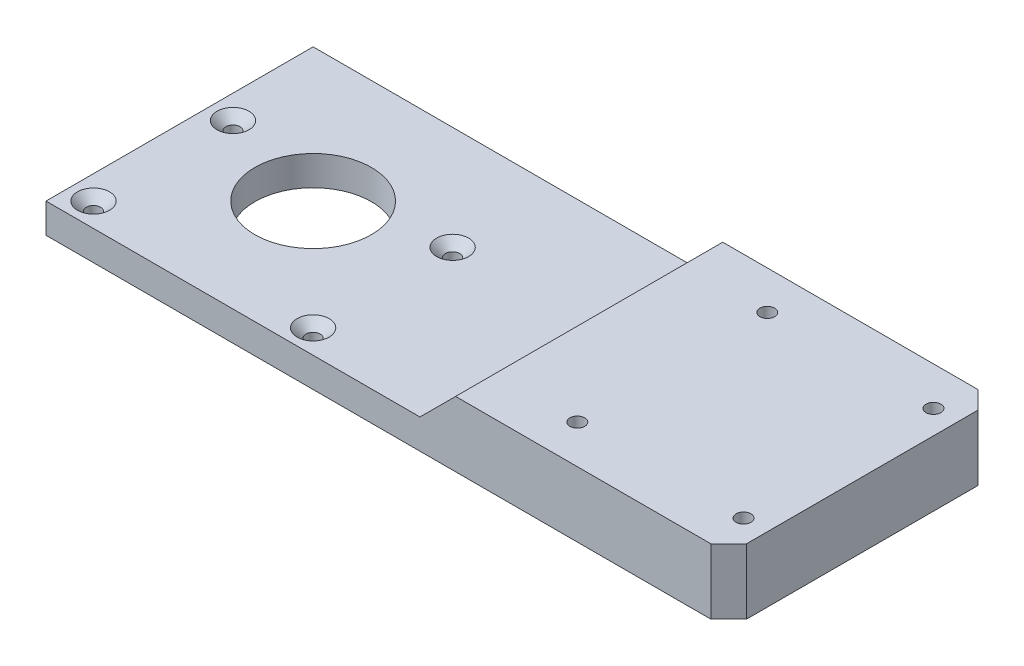
ISO-10303-21;
HEADER;
FILE_DESCRIPTION(('STEP AP214'),'2;1');
FILE_NAME('part.step','',(''),(''),'','','');
FILE_SCHEMA(('AUTOMOTIVE_DESIGN { 1 0 10303 214 1 1 1 1 }'));
ENDSEC;
DATA;
#1=APPLICATION_CONTEXT('core data for automotive mechanical design processes');
#2=APPLICATION_PROTOCOL_DEFINITION('international standard','automotive_design',2000,#1);
#3=PRODUCT_CONTEXT('',#1,'mechanical');
#4=PRODUCT('Part','Part','',(#3));
#5=PRODUCT_RELATED_PRODUCT_CATEGORY('part','',(#4));
#6=PRODUCT_DEFINITION_FORMATION('','',#4);
#7=PRODUCT_DEFINITION_CONTEXT('part definition',#1,'design');
#8=PRODUCT_DEFINITION('design','',#6,#7);
#9=PRODUCT_DEFINITION_SHAPE('','',#8);
#10=(LENGTH_UNIT() NAMED_UNIT(*) SI_UNIT(.MILLI.,.METRE.));
#11=(NAMED_UNIT(*) PLANE_ANGLE_UNIT() SI_UNIT($,.RADIAN.));
#12=(NAMED_UNIT(*) SI_UNIT($,.STERADIAN.) SOLID_ANGLE_UNIT());
#13=UNCERTAINTY_MEASURE_WITH_UNIT(LENGTH_MEASURE(1.E-05),#10,'distance_accuracy_value','');
#14=(GEOMETRIC_REPRESENTATION_CONTEXT(3) GLOBAL_UNCERTAINTY_ASSIGNED_CONTEXT((#13)) GLOBAL_UNIT_ASSIGNED_CONTEXT((#10,
#11,#12)) REPRESENTATION_CONTEXT('',''));
#15=CARTESIAN_POINT('',(0.,0.,0.));
#16=DIRECTION('',(0.,0.,1.));
#17=DIRECTION('',(1.,0.,0.));
#18=AXIS2_PLACEMENT_3D('',#15,#16,#17);
#19=CARTESIAN_POINT('',(0.,11.,0.));
#20=DIRECTION('',(0.,-1.,0.));
#21=DIRECTION('',(0.,0.,-1.));
#22=AXIS2_PLACEMENT_3D('',#19,#20,#21);
#23=PLANE('',#22);
#24=CARTESIAN_POINT('',(83.,11.,-16.));
#25=DIRECTION('',(0.,1.,0.));
#26=DIRECTION('',(0.,0.,1.));
#27=AXIS2_PLACEMENT_3D('',#24,#25,#26);
#28=CIRCLE('',#27,1.24999999999999);
#29=CARTESIAN_POINT('',(83.,11.,-14.75));
#30=VERTEX_POINT('',#29);
#31=EDGE_CURVE('E357',#30,#30,#28,.T.);
#32=ORIENTED_EDGE('',*,*,#31,.F.);
#33=EDGE_LOOP('',(#32));
#34=FACE_BOUND('',#33,.T.);
#35=CARTESIAN_POINT('',(111.,11.,-16.));
#36=DIRECTION('',(0.,1.,0.));
#37=DIRECTION('',(0.,0.,1.));
#38=AXIS2_PLACEMENT_3D('',#35,#36,#37);
#39=CIRCLE('',#38,1.24999999999999);
#40=CARTESIAN_POINT('',(111.,11.,-14.75));
#41=VERTEX_POINT('',#40);
#42=EDGE_CURVE('E353',#41,#41,#39,.T.);
#43=ORIENTED_EDGE('',*,*,#42,.F.);
#44=EDGE_LOOP('',(#43));
#45=FACE_BOUND('',#44,.T.);
#46=CARTESIAN_POINT('',(111.,11.,16.));
#47=DIRECTION('',(0.,1.,0.));
#48=DIRECTION('',(0.,0.,1.));
#49=AXIS2_PLACEMENT_3D('',#46,#47,#48);
#50=CIRCLE('',#49,1.24999999999999);
#51=CARTESIAN_POINT('',(111.,11.,17.25));
#52=VERTEX_POINT('',#51);
#53=EDGE_CURVE('E136',#52,#52,#50,.T.);
#54=ORIENTED_EDGE('',*,*,#53,.F.);
#55=EDGE_LOOP('',(#54));
#56=FACE_BOUND('',#55,.T.);
#57=DIRECTION('',(0.,0.,-1.));
#58=VECTOR('',#57,1.);
#59=CARTESIAN_POINT('',(115.,11.,-22.5));
#60=LINE('',#59,#58);
#61=CARTESIAN_POINT('',(115.,11.,19.5));
#62=VERTEX_POINT('',#61);
#63=CARTESIAN_POINT('',(115.,11.,-19.5));
#64=VERTEX_POINT('',#63);
#65=EDGE_CURVE('E130',#62,#64,#60,.T.);
#66=ORIENTED_EDGE('',*,*,#65,.T.);
#67=DIRECTION('',(-0.707106781186546,0.,-0.707106781186549));
#68=VECTOR('',#67,1.);
#69=CARTESIAN_POINT('',(112.,11.,-22.5));
#70=LINE('',#69,#68);
#71=CARTESIAN_POINT('',(112.,11.,-22.5));
#72=VERTEX_POINT('',#71);
#73=EDGE_CURVE('E46',#64,#72,#70,.T.);
#74=ORIENTED_EDGE('',*,*,#73,.T.);
#75=DIRECTION('',(-1.,0.,0.));
#76=VECTOR('',#75,1.);
#77=CARTESIAN_POINT('',(115.,11.,-22.5));
#78=LINE('',#77,#76);
#79=CARTESIAN_POINT('',(69.,11.,-22.5));
#80=VERTEX_POINT('',#79);
#81=EDGE_CURVE('E133',#72,#80,#78,.T.);
#82=ORIENTED_EDGE('',*,*,#81,.T.);
#83=DIRECTION('',(0.,0.,1.));
#84=VECTOR('',#83,1.);
#85=CARTESIAN_POINT('',(69.,11.,0.));
#86=LINE('',#85,#84);
#87=CARTESIAN_POINT('',(69.,11.,22.5));
#88=VERTEX_POINT('',#87);
#89=EDGE_CURVE('E114',#80,#88,#86,.T.);
#90=ORIENTED_EDGE('',*,*,#89,.T.);
#91=DIRECTION('',(1.,0.,0.));
#92=VECTOR('',#91,1.);
#93=CARTESIAN_POINT('',(115.,11.,22.5));
#94=LINE('',#93,#92);
#95=CARTESIAN_POINT('',(112.,11.,22.5));
#96=VERTEX_POINT('',#95);
#97=EDGE_CURVE('E108',#88,#96,#94,.T.);
#98=ORIENTED_EDGE('',*,*,#97,.T.);
#99=DIRECTION('',(-0.707106781186549,0.,0.707106781186546));
#100=VECTOR('',#99,1.);
#101=CARTESIAN_POINT('',(115.,11.,19.5));
#102=LINE('',#101,#100);
#103=EDGE_CURVE('E211',#96,#62,#102,.F.);
#104=ORIENTED_EDGE('',*,*,#103,.T.);
#105=EDGE_LOOP('',(#66,#74,#82,#90,#98,#104));
#106=FACE_BOUND('',#105,.T.);
#107=CARTESIAN_POINT('',(83.,11.,16.));
#108=DIRECTION('',(0.,1.,0.));
#109=DIRECTION('',(0.,0.,1.));
#110=AXIS2_PLACEMENT_3D('',#107,#108,#109);
#111=CIRCLE('',#110,1.24999999999999);
#112=CARTESIAN_POINT('',(83.,11.,17.25));
#113=VERTEX_POINT('',#112);
#114=EDGE_CURVE('E347',#113,#113,#111,.T.);
#115=ORIENTED_EDGE('',*,*,#114,.F.);
#116=EDGE_LOOP('',(#115));
#117=FACE_BOUND('',#116,.T.);
#118=ADVANCED_FACE('F38',(#34,#45,#56,#106,#117),#23,.F.);
#119=CARTESIAN_POINT('',(0.,5.,22.5));
#120=DIRECTION('',(0.,0.,-1.));
#121=DIRECTION('',(-1.,0.,0.));
#122=AXIS2_PLACEMENT_3D('',#119,#120,#121);
#123=PLANE('',#122);
#124=DIRECTION('',(1.,0.,0.));
#125=VECTOR('',#124,1.);
#126=CARTESIAN_POINT('',(0.,0.,22.5));
#127=LINE('',#126,#125);
#128=CARTESIAN_POINT('',(0.,0.,22.5));
#129=VERTEX_POINT('',#128);
#130=CARTESIAN_POINT('',(112.,0.,22.5));
#131=VERTEX_POINT('',#130);
#132=EDGE_CURVE('E182',#129,#131,#127,.T.);
#133=ORIENTED_EDGE('',*,*,#132,.T.);
#134=DIRECTION('',(0.,1.,0.));
#135=VECTOR('',#134,1.);
#136=CARTESIAN_POINT('',(112.,5.,22.5));
#137=LINE('',#136,#135);
#138=EDGE_CURVE('E11',#131,#96,#137,.T.);
#139=ORIENTED_EDGE('',*,*,#138,.T.);
#140=ORIENTED_EDGE('',*,*,#97,.F.);
#141=DIRECTION('',(0.707106781186546,0.707106781186549,0.));
#142=VECTOR('',#141,1.);
#143=CARTESIAN_POINT('',(69.,11.,22.5));
#144=LINE('',#143,#142);
#145=CARTESIAN_POINT('',(63.,5.,22.5));
#146=VERTEX_POINT('',#145);
#147=EDGE_CURVE('E103',#88,#146,#144,.F.);
#148=ORIENTED_EDGE('',*,*,#147,.T.);
#149=DIRECTION('',(1.,0.,0.));
#150=VECTOR('',#149,1.);
#151=CARTESIAN_POINT('',(0.,5.,22.5));
#152=LINE('',#151,#150);
#153=CARTESIAN_POINT('',(0.,5.,22.5));
#154=VERTEX_POINT('',#153);
#155=EDGE_CURVE('E106',#154,#146,#152,.T.);
#156=ORIENTED_EDGE('',*,*,#155,.F.);
#157=DIRECTION('',(0.,-1.,0.));
#158=VECTOR('',#157,1.);
#159=CARTESIAN_POINT('',(0.,5.,22.5));
#160=LINE('',#159,#158);
#161=EDGE_CURVE('E186',#154,#129,#160,.T.);
#162=ORIENTED_EDGE('',*,*,#161,.T.);
#163=EDGE_LOOP('',(#133,#139,#140,#148,#156,#162));
#164=FACE_BOUND('',#163,.T.);
#165=ADVANCED_FACE('F105',(#164),#123,.F.);
#166=CARTESIAN_POINT('',(115.,5.,22.5));
#167=DIRECTION('',(-1.,0.,0.));
#168=DIRECTION('',(0.,0.,1.));
#169=AXIS2_PLACEMENT_3D('',#166,#167,#168);
#170=PLANE('',#169);
#171=DIRECTION('',(0.,0.,-1.));
#172=VECTOR('',#171,1.);
#173=CARTESIAN_POINT('',(115.,0.,22.5));
#174=LINE('',#173,#172);
#175=CARTESIAN_POINT('',(115.,0.,19.5));
#176=VERTEX_POINT('',#175);
#177=CARTESIAN_POINT('',(115.,0.,-19.5));
#178=VERTEX_POINT('',#177);
#179=EDGE_CURVE('E188',#176,#178,#174,.T.);
#180=ORIENTED_EDGE('',*,*,#179,.T.);
#181=DIRECTION('',(0.,1.,0.));
#182=VECTOR('',#181,1.);
#183=CARTESIAN_POINT('',(115.,11.,-19.5));
#184=LINE('',#183,#182);
#185=EDGE_CURVE('E59',#178,#64,#184,.T.);
#186=ORIENTED_EDGE('',*,*,#185,.T.);
#187=ORIENTED_EDGE('',*,*,#65,.F.);
#188=DIRECTION('',(0.,-1.,0.));
#189=VECTOR('',#188,1.);
#190=CARTESIAN_POINT('',(115.,5.,19.5));
#191=LINE('',#190,#189);
#192=EDGE_CURVE('E207',#62,#176,#191,.T.);
#193=ORIENTED_EDGE('',*,*,#192,.T.);
#194=EDGE_LOOP('',(#180,#186,#187,#193));
#195=FACE_BOUND('',#194,.T.);
#196=ADVANCED_FACE('F225',(#195),#170,.F.);
#197=CARTESIAN_POINT('',(0.,5.,-22.5));
#198=DIRECTION('',(0.,0.,-1.));
#199=DIRECTION('',(-1.,0.,0.));
#200=AXIS2_PLACEMENT_3D('',#197,#198,#199);
#201=PLANE('',#200);
#202=ORIENTED_EDGE('',*,*,#81,.F.);
#203=DIRECTION('',(0.,-1.,0.));
#204=VECTOR('',#203,1.);
#205=CARTESIAN_POINT('',(112.,0.,-22.5));
#206=LINE('',#205,#204);
#207=CARTESIAN_POINT('',(112.,0.,-22.5));
#208=VERTEX_POINT('',#207);
#209=EDGE_CURVE('E200',#72,#208,#206,.T.);
#210=ORIENTED_EDGE('',*,*,#209,.T.);
#211=DIRECTION('',(1.,0.,0.));
#212=VECTOR('',#211,1.);
#213=CARTESIAN_POINT('',(0.,0.,-22.5));
#214=LINE('',#213,#212);
#215=CARTESIAN_POINT('',(0.,0.,-22.5));
#216=VERTEX_POINT('',#215);
#217=EDGE_CURVE('E190',#216,#208,#214,.T.);
#218=ORIENTED_EDGE('',*,*,#217,.F.);
#219=DIRECTION('',(0.,-1.,0.));
#220=VECTOR('',#219,1.);
#221=CARTESIAN_POINT('',(0.,5.,-22.5));
#222=LINE('',#221,#220);
#223=CARTESIAN_POINT('',(0.,5.,-22.5));
#224=VERTEX_POINT('',#223);
#225=EDGE_CURVE('E196',#224,#216,#222,.T.);
#226=ORIENTED_EDGE('',*,*,#225,.F.);
#227=DIRECTION('',(1.,0.,0.));
#228=VECTOR('',#227,1.);
#229=CARTESIAN_POINT('',(0.,5.,-22.5));
#230=LINE('',#229,#228);
#231=CARTESIAN_POINT('',(63.,5.,-22.5));
#232=VERTEX_POINT('',#231);
#233=EDGE_CURVE('E124',#224,#232,#230,.T.);
#234=ORIENTED_EDGE('',*,*,#233,.T.);
#235=DIRECTION('',(-0.707106781186546,-0.707106781186549,0.));
#236=VECTOR('',#235,1.);
#237=CARTESIAN_POINT('',(31.5000000000002,-26.5,-22.5));
#238=LINE('',#237,#236);
#239=EDGE_CURVE('E113',#232,#80,#238,.F.);
#240=ORIENTED_EDGE('',*,*,#239,.T.);
#241=EDGE_LOOP('',(#202,#210,#218,#226,#234,#240));
#242=FACE_BOUND('',#241,.T.);
#243=ADVANCED_FACE('F219',(#242),#201,.T.);
#244=CARTESIAN_POINT('',(0.,5.,22.5));
#245=DIRECTION('',(-1.,0.,0.));
#246=DIRECTION('',(0.,0.,1.));
#247=AXIS2_PLACEMENT_3D('',#244,#245,#246);
#248=PLANE('',#247);
#249=DIRECTION('',(0.,0.,-1.));
#250=VECTOR('',#249,1.);
#251=CARTESIAN_POINT('',(0.,0.,22.5));
#252=LINE('',#251,#250);
#253=EDGE_CURVE('E125',#129,#216,#252,.T.);
#254=ORIENTED_EDGE('',*,*,#253,.F.);
#255=ORIENTED_EDGE('',*,*,#161,.F.);
#256=DIRECTION('',(0.,0.,-1.));
#257=VECTOR('',#256,1.);
#258=CARTESIAN_POINT('',(0.,5.,22.5));
#259=LINE('',#258,#257);
#260=EDGE_CURVE('E123',#154,#224,#259,.T.);
#261=ORIENTED_EDGE('',*,*,#260,.T.);
#262=ORIENTED_EDGE('',*,*,#225,.T.);
#263=EDGE_LOOP('',(#254,#255,#261,#262));
#264=FACE_BOUND('',#263,.T.);
#265=ADVANCED_FACE('F232',(#264),#248,.T.);
#266=CARTESIAN_POINT('',(0.,5.,0.));
#267=DIRECTION('',(0.,1.,0.));
#268=DIRECTION('',(0.,0.,1.));
#269=AXIS2_PLACEMENT_3D('',#266,#267,#268);
#270=PLANE('',#269);
#271=DIRECTION('',(0.,0.,1.));
#272=VECTOR('',#271,1.);
#273=CARTESIAN_POINT('',(63.,5.,-22.5));
#274=LINE('',#273,#272);
#275=EDGE_CURVE('E120',#232,#146,#274,.T.);
#276=ORIENTED_EDGE('',*,*,#275,.F.);
#277=ORIENTED_EDGE('',*,*,#233,.F.);
#278=ORIENTED_EDGE('',*,*,#260,.F.);
#279=ORIENTED_EDGE('',*,*,#155,.T.);
#280=EDGE_LOOP('',(#276,#277,#278,#279));
#281=FACE_BOUND('',#280,.T.);
#282=CARTESIAN_POINT('',(4.,5.,18.5));
#283=DIRECTION('',(0.,1.,0.));
#284=DIRECTION('',(0.,0.,1.));
#285=AXIS2_PLACEMENT_3D('',#282,#283,#284);
#286=CIRCLE('',#285,2.7);
#287=CARTESIAN_POINT('',(4.,5.,21.2));
#288=VERTEX_POINT('',#287);
#289=EDGE_CURVE('E141',#288,#288,#286,.T.);
#290=ORIENTED_EDGE('',*,*,#289,.F.);
#291=EDGE_LOOP('',(#290));
#292=FACE_BOUND('',#291,.T.);
#293=CARTESIAN_POINT('',(41.,5.,18.5));
#294=DIRECTION('',(0.,1.,0.));
#295=DIRECTION('',(0.,0.,1.));
#296=AXIS2_PLACEMENT_3D('',#293,#294,#295);
#297=CIRCLE('',#296,2.7);
#298=CARTESIAN_POINT('',(41.,5.,21.2));
#299=VERTEX_POINT('',#298);
#300=EDGE_CURVE('E150',#299,#299,#297,.T.);
#301=ORIENTED_EDGE('',*,*,#300,.F.);
#302=EDGE_LOOP('',(#301));
#303=FACE_BOUND('',#302,.T.);
#304=CARTESIAN_POINT('',(41.,5.,-5.));
#305=DIRECTION('',(0.,1.,0.));
#306=DIRECTION('',(0.,0.,1.));
#307=AXIS2_PLACEMENT_3D('',#304,#305,#306);
#308=CIRCLE('',#307,2.7);
#309=CARTESIAN_POINT('',(41.,5.,-2.3));
#310=VERTEX_POINT('',#309);
#311=EDGE_CURVE('E159',#310,#310,#308,.T.);
#312=ORIENTED_EDGE('',*,*,#311,.F.);
#313=EDGE_LOOP('',(#312));
#314=FACE_BOUND('',#313,.T.);
#315=CARTESIAN_POINT('',(4.,5.,-5.));
#316=DIRECTION('',(0.,1.,0.));
#317=DIRECTION('',(0.,0.,1.));
#318=AXIS2_PLACEMENT_3D('',#315,#316,#317);
#319=CIRCLE('',#318,2.7);
#320=CARTESIAN_POINT('',(4.,5.,-2.3));
#321=VERTEX_POINT('',#320);
#322=EDGE_CURVE('E168',#321,#321,#319,.T.);
#323=ORIENTED_EDGE('',*,*,#322,.F.);
#324=EDGE_LOOP('',(#323));
#325=FACE_BOUND('',#324,.T.);
#326=CARTESIAN_POINT('',(22.5,5.,0.));
#327=DIRECTION('',(0.,1.,0.));
#328=DIRECTION('',(0.,0.,1.));
#329=AXIS2_PLACEMENT_3D('',#326,#327,#328);
#330=CIRCLE('',#329,9.81710000000001);
#331=CARTESIAN_POINT('',(22.5,5.,9.81710000000001));
#332=VERTEX_POINT('',#331);
#333=EDGE_CURVE('E177',#332,#332,#330,.T.);
#334=ORIENTED_EDGE('',*,*,#333,.F.);
#335=EDGE_LOOP('',(#334));
#336=FACE_BOUND('',#335,.T.);
#337=ADVANCED_FACE('F117',(#281,#292,#303,#314,#325,#336),#270,.T.);
#338=CARTESIAN_POINT('',(0.,0.,0.));
#339=DIRECTION('',(0.,1.,0.));
#340=DIRECTION('',(0.,0.,1.));
#341=AXIS2_PLACEMENT_3D('',#338,#339,#340);
#342=PLANE('',#341);
#343=CARTESIAN_POINT('',(83.,0.,-16.));
#344=DIRECTION('',(0.,1.,0.));
#345=DIRECTION('',(0.,0.,1.));
#346=AXIS2_PLACEMENT_3D('',#343,#344,#345);
#347=CIRCLE('',#346,1.25);
#348=CARTESIAN_POINT('',(83.,0.,-14.75));
#349=VERTEX_POINT('',#348);
#350=EDGE_CURVE('E297',#349,#349,#347,.T.);
#351=ORIENTED_EDGE('',*,*,#350,.T.);
#352=EDGE_LOOP('',(#351));
#353=FACE_BOUND('',#352,.T.);
#354=CARTESIAN_POINT('',(111.,0.,-16.));
#355=DIRECTION('',(0.,1.,0.));
#356=DIRECTION('',(0.,0.,1.));
#357=AXIS2_PLACEMENT_3D('',#354,#355,#356);
#358=CIRCLE('',#357,1.25);
#359=CARTESIAN_POINT('',(111.,0.,-14.75));
#360=VERTEX_POINT('',#359);
#361=EDGE_CURVE('E301',#360,#360,#358,.T.);
#362=ORIENTED_EDGE('',*,*,#361,.T.);
#363=EDGE_LOOP('',(#362));
#364=FACE_BOUND('',#363,.T.);
#365=CARTESIAN_POINT('',(83.,0.,16.));
#366=DIRECTION('',(0.,1.,0.));
#367=DIRECTION('',(0.,0.,1.));
#368=AXIS2_PLACEMENT_3D('',#365,#366,#367);
#369=CIRCLE('',#368,1.25);
#370=CARTESIAN_POINT('',(83.,0.,17.25));
#371=VERTEX_POINT('',#370);
#372=EDGE_CURVE('E305',#371,#371,#369,.T.);
#373=ORIENTED_EDGE('',*,*,#372,.T.);
#374=EDGE_LOOP('',(#373));
#375=FACE_BOUND('',#374,.T.);
#376=CARTESIAN_POINT('',(111.,0.,16.));
#377=DIRECTION('',(0.,1.,0.));
#378=DIRECTION('',(0.,0.,1.));
#379=AXIS2_PLACEMENT_3D('',#376,#377,#378);
#380=CIRCLE('',#379,1.25);
#381=CARTESIAN_POINT('',(111.,0.,17.25));
#382=VERTEX_POINT('',#381);
#383=EDGE_CURVE('E131',#382,#382,#380,.T.);
#384=ORIENTED_EDGE('',*,*,#383,.T.);
#385=EDGE_LOOP('',(#384));
#386=FACE_BOUND('',#385,.T.);
#387=CARTESIAN_POINT('',(4.,0.,18.5));
#388=DIRECTION('',(0.,1.,0.));
#389=DIRECTION('',(0.,0.,1.));
#390=AXIS2_PLACEMENT_3D('',#387,#388,#389);
#391=CIRCLE('',#390,1.19999999999999);
#392=CARTESIAN_POINT('',(4.,0.,19.7));
#393=VERTEX_POINT('',#392);
#394=EDGE_CURVE('E147',#393,#393,#391,.T.);
#395=ORIENTED_EDGE('',*,*,#394,.T.);
#396=EDGE_LOOP('',(#395));
#397=FACE_BOUND('',#396,.T.);
#398=CARTESIAN_POINT('',(41.,0.,18.5));
#399=DIRECTION('',(0.,1.,0.));
#400=DIRECTION('',(0.,0.,1.));
#401=AXIS2_PLACEMENT_3D('',#398,#399,#400);
#402=CIRCLE('',#401,1.19999999999999);
#403=CARTESIAN_POINT('',(41.,0.,19.7));
#404=VERTEX_POINT('',#403);
#405=EDGE_CURVE('E156',#404,#404,#402,.T.);
#406=ORIENTED_EDGE('',*,*,#405,.T.);
#407=EDGE_LOOP('',(#406));
#408=FACE_BOUND('',#407,.T.);
#409=CARTESIAN_POINT('',(41.,0.,-5.));
#410=DIRECTION('',(0.,1.,0.));
#411=DIRECTION('',(0.,0.,1.));
#412=AXIS2_PLACEMENT_3D('',#409,#410,#411);
#413=CIRCLE('',#412,1.19999999999999);
#414=CARTESIAN_POINT('',(41.,0.,-3.80000000000002));
#415=VERTEX_POINT('',#414);
#416=EDGE_CURVE('E165',#415,#415,#413,.T.);
#417=ORIENTED_EDGE('',*,*,#416,.T.);
#418=EDGE_LOOP('',(#417));
#419=FACE_BOUND('',#418,.T.);
#420=CARTESIAN_POINT('',(4.,0.,-5.));
#421=DIRECTION('',(0.,1.,0.));
#422=DIRECTION('',(0.,0.,1.));
#423=AXIS2_PLACEMENT_3D('',#420,#421,#422);
#424=CIRCLE('',#423,1.19999999999999);
#425=CARTESIAN_POINT('',(4.,0.,-3.80000000000001));
#426=VERTEX_POINT('',#425);
#427=EDGE_CURVE('E174',#426,#426,#424,.T.);
#428=ORIENTED_EDGE('',*,*,#427,.T.);
#429=EDGE_LOOP('',(#428));
#430=FACE_BOUND('',#429,.T.);
#431=CARTESIAN_POINT('',(22.5,0.,0.));
#432=DIRECTION('',(0.,1.,0.));
#433=DIRECTION('',(0.,0.,1.));
#434=AXIS2_PLACEMENT_3D('',#431,#432,#433);
#435=CIRCLE('',#434,9.81710000000001);
#436=CARTESIAN_POINT('',(22.5,0.,9.81710000000001));
#437=VERTEX_POINT('',#436);
#438=EDGE_CURVE('E180',#437,#437,#435,.F.);
#439=ORIENTED_EDGE('',*,*,#438,.F.);
#440=EDGE_LOOP('',(#439));
#441=FACE_BOUND('',#440,.T.);
#442=ORIENTED_EDGE('',*,*,#217,.T.);
#443=DIRECTION('',(0.707106781186546,0.,0.707106781186549));
#444=VECTOR('',#443,1.);
#445=CARTESIAN_POINT('',(112.,0.,-22.5));
#446=LINE('',#445,#444);
#447=EDGE_CURVE('E205',#208,#178,#446,.T.);
#448=ORIENTED_EDGE('',*,*,#447,.T.);
#449=ORIENTED_EDGE('',*,*,#179,.F.);
#450=DIRECTION('',(0.707106781186549,0.,-0.707106781186546));
#451=VECTOR('',#450,1.);
#452=CARTESIAN_POINT('',(115.,0.,19.5));
#453=LINE('',#452,#451);
#454=EDGE_CURVE('E203',#176,#131,#453,.F.);
#455=ORIENTED_EDGE('',*,*,#454,.T.);
#456=ORIENTED_EDGE('',*,*,#132,.F.);
#457=ORIENTED_EDGE('',*,*,#253,.T.);
#458=EDGE_LOOP('',(#442,#448,#449,#455,#456,#457));
#459=FACE_BOUND('',#458,.T.);
#460=ADVANCED_FACE('F224',(#353,#364,#375,#386,#397,#408,#419,#430,#441,#459),#342,.F.);
#461=CARTESIAN_POINT('',(22.5,-0.00100000000000013,0.));
#462=DIRECTION('',(0.,1.,0.));
#463=DIRECTION('',(0.,0.,1.));
#464=AXIS2_PLACEMENT_3D('',#461,#462,#463);
#465=CYLINDRICAL_SURFACE('',#464,9.81710000000001);
#466=ORIENTED_EDGE('',*,*,#333,.T.);
#467=EDGE_LOOP('',(#466));
#468=FACE_BOUND('',#467,.T.);
#469=ORIENTED_EDGE('',*,*,#438,.T.);
#470=EDGE_LOOP('',(#469));
#471=FACE_BOUND('',#470,.T.);
#472=ADVANCED_FACE('F286',(#468,#471),#465,.F.);
#473=CARTESIAN_POINT('',(4.,5.,-5.));
#474=DIRECTION('',(0.,1.,0.));
#475=DIRECTION('',(0.,0.,1.));
#476=AXIS2_PLACEMENT_3D('',#473,#474,#475);
#477=CYLINDRICAL_SURFACE('',#476,1.19999999999999);
#478=ORIENTED_EDGE('',*,*,#427,.F.);
#479=EDGE_LOOP('',(#478));
#480=FACE_BOUND('',#479,.T.);
#481=CARTESIAN_POINT('',(4.,3.5,-5.));
#482=DIRECTION('',(0.,1.,0.));
#483=DIRECTION('',(0.,0.,1.));
#484=AXIS2_PLACEMENT_3D('',#481,#482,#483);
#485=CIRCLE('',#484,1.2);
#486=CARTESIAN_POINT('',(4.,3.5,-3.8));
#487=VERTEX_POINT('',#486);
#488=EDGE_CURVE('E171',#487,#487,#485,.T.);
#489=ORIENTED_EDGE('',*,*,#488,.T.);
#490=EDGE_LOOP('',(#489));
#491=FACE_BOUND('',#490,.T.);
#492=ADVANCED_FACE('F282',(#480,#491),#477,.F.);
#493=CARTESIAN_POINT('',(4.,5.,-5.));
#494=DIRECTION('',(0.,1.,0.));
#495=DIRECTION('',(0.,0.,1.));
#496=AXIS2_PLACEMENT_3D('',#493,#494,#495);
#497=CONICAL_SURFACE('',#496,2.7,0.785398163397448);
#498=ORIENTED_EDGE('',*,*,#488,.F.);
#499=EDGE_LOOP('',(#498));
#500=FACE_BOUND('',#499,.T.);
#501=ORIENTED_EDGE('',*,*,#322,.T.);
#502=EDGE_LOOP('',(#501));
#503=FACE_BOUND('',#502,.T.);
#504=ADVANCED_FACE('F278',(#500,#503),#497,.F.);
#505=CARTESIAN_POINT('',(41.,5.,-5.));
#506=DIRECTION('',(0.,1.,0.));
#507=DIRECTION('',(0.,0.,1.));
#508=AXIS2_PLACEMENT_3D('',#505,#506,#507);
#509=CYLINDRICAL_SURFACE('',#508,1.19999999999999);
#510=ORIENTED_EDGE('',*,*,#416,.F.);
#511=EDGE_LOOP('',(#510));
#512=FACE_BOUND('',#511,.T.);
#513=CARTESIAN_POINT('',(41.,3.5,-5.));
#514=DIRECTION('',(0.,1.,0.));
#515=DIRECTION('',(0.,0.,1.));
#516=AXIS2_PLACEMENT_3D('',#513,#514,#515);
#517=CIRCLE('',#516,1.2);
#518=CARTESIAN_POINT('',(41.,3.5,-3.8));
#519=VERTEX_POINT('',#518);
#520=EDGE_CURVE('E162',#519,#519,#517,.T.);
#521=ORIENTED_EDGE('',*,*,#520,.T.);
#522=EDGE_LOOP('',(#521));
#523=FACE_BOUND('',#522,.T.);
#524=ADVANCED_FACE('F274',(#512,#523),#509,.F.);
#525=CARTESIAN_POINT('',(41.,5.,-5.));
#526=DIRECTION('',(0.,1.,0.));
#527=DIRECTION('',(0.,0.,1.));
#528=AXIS2_PLACEMENT_3D('',#525,#526,#527);
#529=CONICAL_SURFACE('',#528,2.7,0.785398163397448);
#530=ORIENTED_EDGE('',*,*,#520,.F.);
#531=EDGE_LOOP('',(#530));
#532=FACE_BOUND('',#531,.T.);
#533=ORIENTED_EDGE('',*,*,#311,.T.);
#534=EDGE_LOOP('',(#533));
#535=FACE_BOUND('',#534,.T.);
#536=ADVANCED_FACE('F270',(#532,#535),#529,.F.);
#537=CARTESIAN_POINT('',(41.,5.,18.5));
#538=DIRECTION('',(0.,1.,0.));
#539=DIRECTION('',(0.,0.,1.));
#540=AXIS2_PLACEMENT_3D('',#537,#538,#539);
#541=CYLINDRICAL_SURFACE('',#540,1.19999999999999);
#542=ORIENTED_EDGE('',*,*,#405,.F.);
#543=EDGE_LOOP('',(#542));
#544=FACE_BOUND('',#543,.T.);
#545=CARTESIAN_POINT('',(41.,3.5,18.5));
#546=DIRECTION('',(0.,1.,0.));
#547=DIRECTION('',(0.,0.,1.));
#548=AXIS2_PLACEMENT_3D('',#545,#546,#547);
#549=CIRCLE('',#548,1.2);
#550=CARTESIAN_POINT('',(41.,3.5,19.7));
#551=VERTEX_POINT('',#550);
#552=EDGE_CURVE('E153',#551,#551,#549,.T.);
#553=ORIENTED_EDGE('',*,*,#552,.T.);
#554=EDGE_LOOP('',(#553));
#555=FACE_BOUND('',#554,.T.);
#556=ADVANCED_FACE('F266',(#544,#555),#541,.F.);
#557=CARTESIAN_POINT('',(41.,5.,18.5));
#558=DIRECTION('',(0.,1.,0.));
#559=DIRECTION('',(0.,0.,1.));
#560=AXIS2_PLACEMENT_3D('',#557,#558,#559);
#561=CONICAL_SURFACE('',#560,2.7,0.785398163397448);
#562=ORIENTED_EDGE('',*,*,#552,.F.);
#563=EDGE_LOOP('',(#562));
#564=FACE_BOUND('',#563,.T.);
#565=ORIENTED_EDGE('',*,*,#300,.T.);
#566=EDGE_LOOP('',(#565));
#567=FACE_BOUND('',#566,.T.);
#568=ADVANCED_FACE('F262',(#564,#567),#561,.F.);
#569=CARTESIAN_POINT('',(4.,5.,18.5));
#570=DIRECTION('',(0.,1.,0.));
#571=DIRECTION('',(0.,0.,1.));
#572=AXIS2_PLACEMENT_3D('',#569,#570,#571);
#573=CYLINDRICAL_SURFACE('',#572,1.19999999999999);
#574=ORIENTED_EDGE('',*,*,#394,.F.);
#575=EDGE_LOOP('',(#574));
#576=FACE_BOUND('',#575,.T.);
#577=CARTESIAN_POINT('',(4.,3.5,18.5));
#578=DIRECTION('',(0.,1.,0.));
#579=DIRECTION('',(0.,0.,1.));
#580=AXIS2_PLACEMENT_3D('',#577,#578,#579);
#581=CIRCLE('',#580,1.2);
#582=CARTESIAN_POINT('',(4.,3.5,19.7));
#583=VERTEX_POINT('',#582);
#584=EDGE_CURVE('E144',#583,#583,#581,.T.);
#585=ORIENTED_EDGE('',*,*,#584,.T.);
#586=EDGE_LOOP('',(#585));
#587=FACE_BOUND('',#586,.T.);
#588=ADVANCED_FACE('F258',(#576,#587),#573,.F.);
#589=CARTESIAN_POINT('',(4.,5.,18.5));
#590=DIRECTION('',(0.,1.,0.));
#591=DIRECTION('',(0.,0.,1.));
#592=AXIS2_PLACEMENT_3D('',#589,#590,#591);
#593=CONICAL_SURFACE('',#592,2.7,0.785398163397448);
#594=ORIENTED_EDGE('',*,*,#584,.F.);
#595=EDGE_LOOP('',(#594));
#596=FACE_BOUND('',#595,.T.);
#597=ORIENTED_EDGE('',*,*,#289,.T.);
#598=EDGE_LOOP('',(#597));
#599=FACE_BOUND('',#598,.T.);
#600=ADVANCED_FACE('F255',(#596,#599),#593,.F.);
#601=CARTESIAN_POINT('',(69.,11.,0.));
#602=DIRECTION('',(0.707106781186549,-0.707106781186546,0.));
#603=DIRECTION('',(0.,0.,1.));
#604=AXIS2_PLACEMENT_3D('',#601,#602,#603);
#605=PLANE('',#604);
#606=ORIENTED_EDGE('',*,*,#239,.F.);
#607=ORIENTED_EDGE('',*,*,#275,.T.);
#608=ORIENTED_EDGE('',*,*,#147,.F.);
#609=ORIENTED_EDGE('',*,*,#89,.F.);
#610=EDGE_LOOP('',(#606,#607,#608,#609));
#611=FACE_BOUND('',#610,.T.);
#612=ADVANCED_FACE('F128',(#611),#605,.F.);
#613=CARTESIAN_POINT('',(111.,11.,16.));
#614=DIRECTION('',(0.,1.,0.));
#615=DIRECTION('',(0.,0.,1.));
#616=AXIS2_PLACEMENT_3D('',#613,#614,#615);
#617=CYLINDRICAL_SURFACE('',#616,1.24999999999999);
#618=ORIENTED_EDGE('',*,*,#383,.F.);
#619=EDGE_LOOP('',(#618));
#620=FACE_BOUND('',#619,.T.);
#621=ORIENTED_EDGE('',*,*,#53,.T.);
#622=EDGE_LOOP('',(#621));
#623=FACE_BOUND('',#622,.T.);
#624=ADVANCED_FACE('F253',(#620,#623),#617,.F.);
#625=CARTESIAN_POINT('',(83.,11.,16.));
#626=DIRECTION('',(0.,1.,0.));
#627=DIRECTION('',(0.,0.,1.));
#628=AXIS2_PLACEMENT_3D('',#625,#626,#627);
#629=CYLINDRICAL_SURFACE('',#628,1.24999999999999);
#630=ORIENTED_EDGE('',*,*,#372,.F.);
#631=EDGE_LOOP('',(#630));
#632=FACE_BOUND('',#631,.T.);
#633=ORIENTED_EDGE('',*,*,#114,.T.);
#634=EDGE_LOOP('',(#633));
#635=FACE_BOUND('',#634,.T.);
#636=ADVANCED_FACE('F342',(#632,#635),#629,.F.);
#637=CARTESIAN_POINT('',(111.,11.,-16.));
#638=DIRECTION('',(0.,1.,0.));
#639=DIRECTION('',(0.,0.,1.));
#640=AXIS2_PLACEMENT_3D('',#637,#638,#639);
#641=CYLINDRICAL_SURFACE('',#640,1.24999999999999);
#642=ORIENTED_EDGE('',*,*,#361,.F.);
#643=EDGE_LOOP('',(#642));
#644=FACE_BOUND('',#643,.T.);
#645=ORIENTED_EDGE('',*,*,#42,.T.);
#646=EDGE_LOOP('',(#645));
#647=FACE_BOUND('',#646,.T.);
#648=ADVANCED_FACE('F362',(#644,#647),#641,.F.);
#649=CARTESIAN_POINT('',(83.,11.,-16.));
#650=DIRECTION('',(0.,1.,0.));
#651=DIRECTION('',(0.,0.,1.));
#652=AXIS2_PLACEMENT_3D('',#649,#650,#651);
#653=CYLINDRICAL_SURFACE('',#652,1.24999999999999);
#654=ORIENTED_EDGE('',*,*,#350,.F.);
#655=EDGE_LOOP('',(#654));
#656=FACE_BOUND('',#655,.T.);
#657=ORIENTED_EDGE('',*,*,#31,.T.);
#658=EDGE_LOOP('',(#657));
#659=FACE_BOUND('',#658,.T.);
#660=ADVANCED_FACE('F360',(#656,#659),#653,.F.);
#661=CARTESIAN_POINT('',(112.,5.,-22.5));
#662=DIRECTION('',(0.707106781186549,0.,-0.707106781186546));
#663=DIRECTION('',(0.,1.,0.));
#664=AXIS2_PLACEMENT_3D('',#661,#662,#663);
#665=PLANE('',#664);
#666=ORIENTED_EDGE('',*,*,#73,.F.);
#667=ORIENTED_EDGE('',*,*,#185,.F.);
#668=ORIENTED_EDGE('',*,*,#447,.F.);
#669=ORIENTED_EDGE('',*,*,#209,.F.);
#670=EDGE_LOOP('',(#666,#667,#668,#669));
#671=FACE_BOUND('',#670,.T.);
#672=ADVANCED_FACE('F221',(#671),#665,.T.);
#673=CARTESIAN_POINT('',(115.,5.,19.5));
#674=DIRECTION('',(-0.707106781186546,0.,-0.707106781186549));
#675=DIRECTION('',(0.,-1.,0.));
#676=AXIS2_PLACEMENT_3D('',#673,#674,#675);
#677=PLANE('',#676);
#678=ORIENTED_EDGE('',*,*,#103,.F.);
#679=ORIENTED_EDGE('',*,*,#138,.F.);
#680=ORIENTED_EDGE('',*,*,#454,.F.);
#681=ORIENTED_EDGE('',*,*,#192,.F.);
#682=EDGE_LOOP('',(#678,#679,#680,#681));
#683=FACE_BOUND('',#682,.T.);
#684=ADVANCED_FACE('F40',(#683),#677,.F.);
#685=CLOSED_SHELL('',(#118,#165,#196,#243,#265,#337,#460,#472,#492,#504,#524,#536,#556,#568,
#588,#600,#612,#624,#636,#648,#660,#672,#684));
#686=MANIFOLD_SOLID_BREP('B2',#685);
#687=ADVANCED_BREP_SHAPE_REPRESENTATION('',(#18,#686),#14);
#688=SHAPE_DEFINITION_REPRESENTATION(#9,#687);
ENDSEC;
END-ISO-10303-21;
